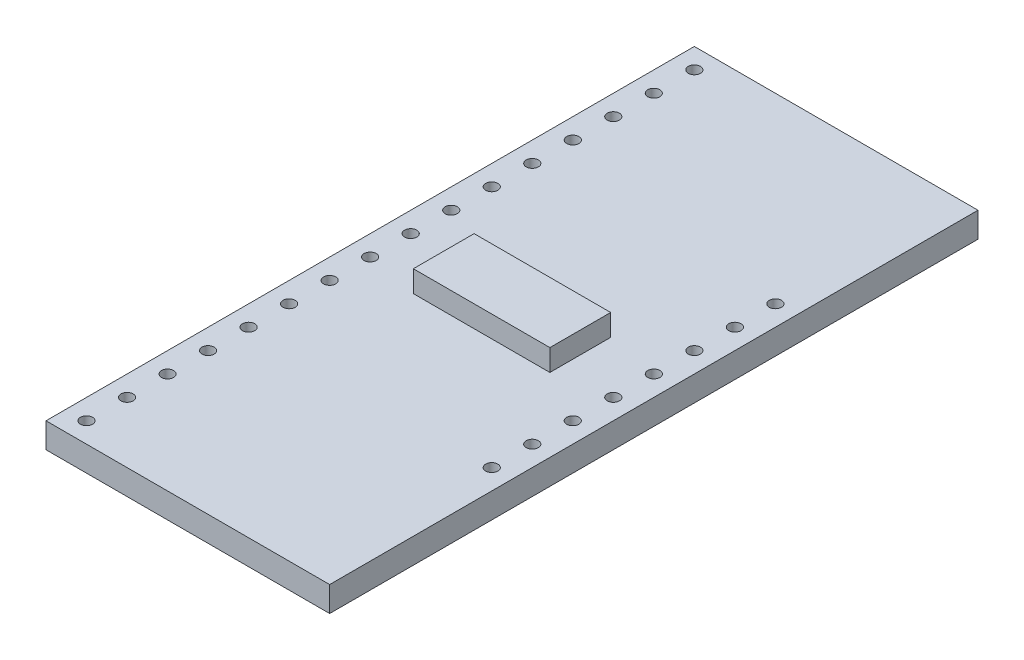
ISO-10303-21;
HEADER;
FILE_DESCRIPTION(('STEP AP214'),'2;1');
FILE_NAME('part.step','',(''),(''),'','','');
FILE_SCHEMA(('AUTOMOTIVE_DESIGN { 1 0 10303 214 1 1 1 1 }'));
ENDSEC;
DATA;
#1=APPLICATION_CONTEXT('core data for automotive mechanical design processes');
#2=APPLICATION_PROTOCOL_DEFINITION('international standard','automotive_design',2000,#1);
#3=PRODUCT_CONTEXT('',#1,'mechanical');
#4=PRODUCT('Part','Part','',(#3));
#5=PRODUCT_RELATED_PRODUCT_CATEGORY('part','',(#4));
#6=PRODUCT_DEFINITION_FORMATION('','',#4);
#7=PRODUCT_DEFINITION_CONTEXT('part definition',#1,'design');
#8=PRODUCT_DEFINITION('design','',#6,#7);
#9=PRODUCT_DEFINITION_SHAPE('','',#8);
#10=(LENGTH_UNIT() NAMED_UNIT(*) SI_UNIT(.MILLI.,.METRE.));
#11=(NAMED_UNIT(*) PLANE_ANGLE_UNIT() SI_UNIT($,.RADIAN.));
#12=(NAMED_UNIT(*) SI_UNIT($,.STERADIAN.) SOLID_ANGLE_UNIT());
#13=UNCERTAINTY_MEASURE_WITH_UNIT(LENGTH_MEASURE(1.E-05),#10,'distance_accuracy_value','');
#14=(GEOMETRIC_REPRESENTATION_CONTEXT(3) GLOBAL_UNCERTAINTY_ASSIGNED_CONTEXT((#13)) GLOBAL_UNIT_ASSIGNED_CONTEXT((#10,
#11,#12)) REPRESENTATION_CONTEXT('',''));
#15=CARTESIAN_POINT('',(0.,0.,0.));
#16=DIRECTION('',(0.,0.,1.));
#17=DIRECTION('',(1.,0.,0.));
#18=AXIS2_PLACEMENT_3D('',#15,#16,#17);
#19=CARTESIAN_POINT('',(0.,1.5748,0.));
#20=DIRECTION('',(0.,-1.,0.));
#21=DIRECTION('',(0.,0.,-1.));
#22=AXIS2_PLACEMENT_3D('',#19,#20,#21);
#23=PLANE('',#22);
#24=CARTESIAN_POINT('',(16.51,1.5748,-29.21));
#25=DIRECTION('',(0.,1.,0.));
#26=DIRECTION('',(0.,0.,1.));
#27=AXIS2_PLACEMENT_3D('',#24,#25,#26);
#28=CIRCLE('',#27,0.380999999999998);
#29=CARTESIAN_POINT('',(16.51,1.5748,-28.829));
#30=VERTEX_POINT('',#29);
#31=EDGE_CURVE('E11',#30,#30,#28,.T.);
#32=ORIENTED_EDGE('',*,*,#31,.F.);
#33=EDGE_LOOP('',(#32));
#34=FACE_BOUND('',#33,.T.);
#35=CARTESIAN_POINT('',(16.51,1.5748,-26.67));
#36=DIRECTION('',(0.,1.,0.));
#37=DIRECTION('',(0.,0.,1.));
#38=AXIS2_PLACEMENT_3D('',#35,#36,#37);
#39=CIRCLE('',#38,0.380999999999998);
#40=CARTESIAN_POINT('',(16.51,1.5748,-26.289));
#41=VERTEX_POINT('',#40);
#42=EDGE_CURVE('E288',#41,#41,#39,.T.);
#43=ORIENTED_EDGE('',*,*,#42,.F.);
#44=EDGE_LOOP('',(#43));
#45=FACE_BOUND('',#44,.T.);
#46=CARTESIAN_POINT('',(16.51,1.5748,-24.13));
#47=DIRECTION('',(0.,1.,0.));
#48=DIRECTION('',(0.,0.,1.));
#49=AXIS2_PLACEMENT_3D('',#46,#47,#48);
#50=CIRCLE('',#49,0.380999999999998);
#51=CARTESIAN_POINT('',(16.51,1.5748,-23.749));
#52=VERTEX_POINT('',#51);
#53=EDGE_CURVE('E282',#52,#52,#50,.T.);
#54=ORIENTED_EDGE('',*,*,#53,.F.);
#55=EDGE_LOOP('',(#54));
#56=FACE_BOUND('',#55,.T.);
#57=CARTESIAN_POINT('',(16.51,1.5748,-21.59));
#58=DIRECTION('',(0.,1.,0.));
#59=DIRECTION('',(0.,0.,1.));
#60=AXIS2_PLACEMENT_3D('',#57,#58,#59);
#61=CIRCLE('',#60,0.380999999999998);
#62=CARTESIAN_POINT('',(16.51,1.5748,-21.209));
#63=VERTEX_POINT('',#62);
#64=EDGE_CURVE('E276',#63,#63,#61,.T.);
#65=ORIENTED_EDGE('',*,*,#64,.F.);
#66=EDGE_LOOP('',(#65));
#67=FACE_BOUND('',#66,.T.);
#68=CARTESIAN_POINT('',(16.51,1.5748,-19.05));
#69=DIRECTION('',(0.,1.,0.));
#70=DIRECTION('',(0.,0.,1.));
#71=AXIS2_PLACEMENT_3D('',#68,#69,#70);
#72=CIRCLE('',#71,0.380999999999998);
#73=CARTESIAN_POINT('',(16.51,1.5748,-18.669));
#74=VERTEX_POINT('',#73);
#75=EDGE_CURVE('E270',#74,#74,#72,.T.);
#76=ORIENTED_EDGE('',*,*,#75,.F.);
#77=EDGE_LOOP('',(#76));
#78=FACE_BOUND('',#77,.T.);
#79=CARTESIAN_POINT('',(16.51,1.5748,-16.51));
#80=DIRECTION('',(0.,1.,0.));
#81=DIRECTION('',(0.,0.,1.));
#82=AXIS2_PLACEMENT_3D('',#79,#80,#81);
#83=CIRCLE('',#82,0.380999999999998);
#84=CARTESIAN_POINT('',(16.51,1.5748,-16.129));
#85=VERTEX_POINT('',#84);
#86=EDGE_CURVE('E264',#85,#85,#83,.T.);
#87=ORIENTED_EDGE('',*,*,#86,.F.);
#88=EDGE_LOOP('',(#87));
#89=FACE_BOUND('',#88,.T.);
#90=CARTESIAN_POINT('',(1.27,1.5748,-39.37));
#91=DIRECTION('',(0.,1.,0.));
#92=DIRECTION('',(0.,0.,1.));
#93=AXIS2_PLACEMENT_3D('',#90,#91,#92);
#94=CIRCLE('',#93,0.381);
#95=CARTESIAN_POINT('',(1.27,1.5748,-38.989));
#96=VERTEX_POINT('',#95);
#97=EDGE_CURVE('E258',#96,#96,#94,.T.);
#98=ORIENTED_EDGE('',*,*,#97,.F.);
#99=EDGE_LOOP('',(#98));
#100=FACE_BOUND('',#99,.T.);
#101=CARTESIAN_POINT('',(1.27,1.5748,-36.83));
#102=DIRECTION('',(0.,1.,0.));
#103=DIRECTION('',(0.,0.,1.));
#104=AXIS2_PLACEMENT_3D('',#101,#102,#103);
#105=CIRCLE('',#104,0.381);
#106=CARTESIAN_POINT('',(1.27,1.5748,-36.449));
#107=VERTEX_POINT('',#106);
#108=EDGE_CURVE('E252',#107,#107,#105,.T.);
#109=ORIENTED_EDGE('',*,*,#108,.F.);
#110=EDGE_LOOP('',(#109));
#111=FACE_BOUND('',#110,.T.);
#112=CARTESIAN_POINT('',(1.27,1.5748,-34.29));
#113=DIRECTION('',(0.,1.,0.));
#114=DIRECTION('',(0.,0.,1.));
#115=AXIS2_PLACEMENT_3D('',#112,#113,#114);
#116=CIRCLE('',#115,0.381);
#117=CARTESIAN_POINT('',(1.27,1.5748,-33.909));
#118=VERTEX_POINT('',#117);
#119=EDGE_CURVE('E246',#118,#118,#116,.T.);
#120=ORIENTED_EDGE('',*,*,#119,.F.);
#121=EDGE_LOOP('',(#120));
#122=FACE_BOUND('',#121,.T.);
#123=CARTESIAN_POINT('',(1.27,1.5748,-31.75));
#124=DIRECTION('',(0.,1.,0.));
#125=DIRECTION('',(0.,0.,1.));
#126=AXIS2_PLACEMENT_3D('',#123,#124,#125);
#127=CIRCLE('',#126,0.381);
#128=CARTESIAN_POINT('',(1.27,1.5748,-31.369));
#129=VERTEX_POINT('',#128);
#130=EDGE_CURVE('E240',#129,#129,#127,.T.);
#131=ORIENTED_EDGE('',*,*,#130,.F.);
#132=EDGE_LOOP('',(#131));
#133=FACE_BOUND('',#132,.T.);
#134=CARTESIAN_POINT('',(1.27,1.5748,-29.21));
#135=DIRECTION('',(0.,1.,0.));
#136=DIRECTION('',(0.,0.,1.));
#137=AXIS2_PLACEMENT_3D('',#134,#135,#136);
#138=CIRCLE('',#137,0.381);
#139=CARTESIAN_POINT('',(1.27,1.5748,-28.829));
#140=VERTEX_POINT('',#139);
#141=EDGE_CURVE('E234',#140,#140,#138,.T.);
#142=ORIENTED_EDGE('',*,*,#141,.F.);
#143=EDGE_LOOP('',(#142));
#144=FACE_BOUND('',#143,.T.);
#145=CARTESIAN_POINT('',(1.27,1.5748,-26.67));
#146=DIRECTION('',(0.,1.,0.));
#147=DIRECTION('',(0.,0.,1.));
#148=AXIS2_PLACEMENT_3D('',#145,#146,#147);
#149=CIRCLE('',#148,0.381);
#150=CARTESIAN_POINT('',(1.27,1.5748,-26.289));
#151=VERTEX_POINT('',#150);
#152=EDGE_CURVE('E228',#151,#151,#149,.T.);
#153=ORIENTED_EDGE('',*,*,#152,.F.);
#154=EDGE_LOOP('',(#153));
#155=FACE_BOUND('',#154,.T.);
#156=CARTESIAN_POINT('',(1.27,1.5748,-24.13));
#157=DIRECTION('',(0.,1.,0.));
#158=DIRECTION('',(0.,0.,1.));
#159=AXIS2_PLACEMENT_3D('',#156,#157,#158);
#160=CIRCLE('',#159,0.381);
#161=CARTESIAN_POINT('',(1.27,1.5748,-23.749));
#162=VERTEX_POINT('',#161);
#163=EDGE_CURVE('E222',#162,#162,#160,.T.);
#164=ORIENTED_EDGE('',*,*,#163,.F.);
#165=EDGE_LOOP('',(#164));
#166=FACE_BOUND('',#165,.T.);
#167=CARTESIAN_POINT('',(1.27,1.5748,-21.59));
#168=DIRECTION('',(0.,1.,0.));
#169=DIRECTION('',(0.,0.,1.));
#170=AXIS2_PLACEMENT_3D('',#167,#168,#169);
#171=CIRCLE('',#170,0.381);
#172=CARTESIAN_POINT('',(1.27,1.5748,-21.209));
#173=VERTEX_POINT('',#172);
#174=EDGE_CURVE('E216',#173,#173,#171,.T.);
#175=ORIENTED_EDGE('',*,*,#174,.F.);
#176=EDGE_LOOP('',(#175));
#177=FACE_BOUND('',#176,.T.);
#178=CARTESIAN_POINT('',(1.27,1.5748,-19.05));
#179=DIRECTION('',(0.,1.,0.));
#180=DIRECTION('',(0.,0.,1.));
#181=AXIS2_PLACEMENT_3D('',#178,#179,#180);
#182=CIRCLE('',#181,0.381);
#183=CARTESIAN_POINT('',(1.27,1.5748,-18.669));
#184=VERTEX_POINT('',#183);
#185=EDGE_CURVE('E210',#184,#184,#182,.T.);
#186=ORIENTED_EDGE('',*,*,#185,.F.);
#187=EDGE_LOOP('',(#186));
#188=FACE_BOUND('',#187,.T.);
#189=CARTESIAN_POINT('',(1.27,1.5748,-16.51));
#190=DIRECTION('',(0.,1.,0.));
#191=DIRECTION('',(0.,0.,1.));
#192=AXIS2_PLACEMENT_3D('',#189,#190,#191);
#193=CIRCLE('',#192,0.381);
#194=CARTESIAN_POINT('',(1.27,1.5748,-16.129));
#195=VERTEX_POINT('',#194);
#196=EDGE_CURVE('E204',#195,#195,#193,.T.);
#197=ORIENTED_EDGE('',*,*,#196,.F.);
#198=EDGE_LOOP('',(#197));
#199=FACE_BOUND('',#198,.T.);
#200=CARTESIAN_POINT('',(1.27,1.5748,-13.97));
#201=DIRECTION('',(0.,1.,0.));
#202=DIRECTION('',(0.,0.,1.));
#203=AXIS2_PLACEMENT_3D('',#200,#201,#202);
#204=CIRCLE('',#203,0.381);
#205=CARTESIAN_POINT('',(1.27,1.5748,-13.589));
#206=VERTEX_POINT('',#205);
#207=EDGE_CURVE('E198',#206,#206,#204,.T.);
#208=ORIENTED_EDGE('',*,*,#207,.F.);
#209=EDGE_LOOP('',(#208));
#210=FACE_BOUND('',#209,.T.);
#211=CARTESIAN_POINT('',(1.27,1.5748,-11.43));
#212=DIRECTION('',(0.,1.,0.));
#213=DIRECTION('',(0.,0.,1.));
#214=AXIS2_PLACEMENT_3D('',#211,#212,#213);
#215=CIRCLE('',#214,0.381);
#216=CARTESIAN_POINT('',(1.27,1.5748,-11.049));
#217=VERTEX_POINT('',#216);
#218=EDGE_CURVE('E192',#217,#217,#215,.T.);
#219=ORIENTED_EDGE('',*,*,#218,.F.);
#220=EDGE_LOOP('',(#219));
#221=FACE_BOUND('',#220,.T.);
#222=CARTESIAN_POINT('',(1.27,1.5748,-8.89));
#223=DIRECTION('',(0.,1.,0.));
#224=DIRECTION('',(0.,0.,1.));
#225=AXIS2_PLACEMENT_3D('',#222,#223,#224);
#226=CIRCLE('',#225,0.381);
#227=CARTESIAN_POINT('',(1.27,1.5748,-8.509));
#228=VERTEX_POINT('',#227);
#229=EDGE_CURVE('E186',#228,#228,#226,.T.);
#230=ORIENTED_EDGE('',*,*,#229,.F.);
#231=EDGE_LOOP('',(#230));
#232=FACE_BOUND('',#231,.T.);
#233=CARTESIAN_POINT('',(1.27,1.5748,-6.35));
#234=DIRECTION('',(0.,1.,0.));
#235=DIRECTION('',(0.,0.,1.));
#236=AXIS2_PLACEMENT_3D('',#233,#234,#235);
#237=CIRCLE('',#236,0.381);
#238=CARTESIAN_POINT('',(1.27,1.5748,-5.969));
#239=VERTEX_POINT('',#238);
#240=EDGE_CURVE('E180',#239,#239,#237,.T.);
#241=ORIENTED_EDGE('',*,*,#240,.F.);
#242=EDGE_LOOP('',(#241));
#243=FACE_BOUND('',#242,.T.);
#244=DIRECTION('',(0.,0.,1.));
#245=VECTOR('',#244,1.);
#246=CARTESIAN_POINT('',(0.,1.5748,0.));
#247=LINE('',#246,#245);
#248=CARTESIAN_POINT('',(0.,1.5748,-40.64));
#249=VERTEX_POINT('',#248);
#250=CARTESIAN_POINT('',(0.,1.5748,0.));
#251=VERTEX_POINT('',#250);
#252=EDGE_CURVE('E148',#249,#251,#247,.T.);
#253=ORIENTED_EDGE('',*,*,#252,.T.);
#254=DIRECTION('',(1.,0.,0.));
#255=VECTOR('',#254,1.);
#256=CARTESIAN_POINT('',(0.,1.5748,0.));
#257=LINE('',#256,#255);
#258=CARTESIAN_POINT('',(17.78,1.5748,0.));
#259=VERTEX_POINT('',#258);
#260=EDGE_CURVE('E151',#251,#259,#257,.T.);
#261=ORIENTED_EDGE('',*,*,#260,.T.);
#262=DIRECTION('',(0.,0.,-1.));
#263=VECTOR('',#262,1.);
#264=CARTESIAN_POINT('',(17.78,1.5748,0.));
#265=LINE('',#264,#263);
#266=CARTESIAN_POINT('',(17.78,1.5748,-40.64));
#267=VERTEX_POINT('',#266);
#268=EDGE_CURVE('E154',#259,#267,#265,.T.);
#269=ORIENTED_EDGE('',*,*,#268,.T.);
#270=DIRECTION('',(-1.,0.,0.));
#271=VECTOR('',#270,1.);
#272=CARTESIAN_POINT('',(0.,1.5748,-40.64));
#273=LINE('',#272,#271);
#274=EDGE_CURVE('E156',#267,#249,#273,.T.);
#275=ORIENTED_EDGE('',*,*,#274,.T.);
#276=EDGE_LOOP('',(#253,#261,#269,#275));
#277=FACE_BOUND('',#276,.T.);
#278=CARTESIAN_POINT('',(1.27,1.5748,-1.27));
#279=DIRECTION('',(0.,1.,0.));
#280=DIRECTION('',(0.,0.,1.));
#281=AXIS2_PLACEMENT_3D('',#278,#279,#280);
#282=CIRCLE('',#281,0.381);
#283=CARTESIAN_POINT('',(1.27,1.5748,-0.889));
#284=VERTEX_POINT('',#283);
#285=EDGE_CURVE('E141',#284,#284,#282,.T.);
#286=ORIENTED_EDGE('',*,*,#285,.F.);
#287=EDGE_LOOP('',(#286));
#288=FACE_BOUND('',#287,.T.);
#289=CARTESIAN_POINT('',(1.27,1.5748,-3.81));
#290=DIRECTION('',(0.,1.,0.));
#291=DIRECTION('',(0.,0.,1.));
#292=AXIS2_PLACEMENT_3D('',#289,#290,#291);
#293=CIRCLE('',#292,0.381);
#294=CARTESIAN_POINT('',(1.27,1.5748,-3.429));
#295=VERTEX_POINT('',#294);
#296=EDGE_CURVE('E138',#295,#295,#293,.T.);
#297=ORIENTED_EDGE('',*,*,#296,.F.);
#298=EDGE_LOOP('',(#297));
#299=FACE_BOUND('',#298,.T.);
#300=CARTESIAN_POINT('',(16.51,1.5748,-11.43));
#301=DIRECTION('',(0.,1.,0.));
#302=DIRECTION('',(0.,0.,1.));
#303=AXIS2_PLACEMENT_3D('',#300,#301,#302);
#304=CIRCLE('',#303,0.380999999999998);
#305=CARTESIAN_POINT('',(16.51,1.5748,-11.049));
#306=VERTEX_POINT('',#305);
#307=EDGE_CURVE('E129',#306,#306,#304,.T.);
#308=ORIENTED_EDGE('',*,*,#307,.F.);
#309=EDGE_LOOP('',(#308));
#310=FACE_BOUND('',#309,.T.);
#311=CARTESIAN_POINT('',(16.51,1.5748,-13.97));
#312=DIRECTION('',(0.,1.,0.));
#313=DIRECTION('',(0.,0.,1.));
#314=AXIS2_PLACEMENT_3D('',#311,#312,#313);
#315=CIRCLE('',#314,0.380999999999998);
#316=CARTESIAN_POINT('',(16.51,1.5748,-13.589));
#317=VERTEX_POINT('',#316);
#318=EDGE_CURVE('E121',#317,#317,#315,.T.);
#319=ORIENTED_EDGE('',*,*,#318,.F.);
#320=EDGE_LOOP('',(#319));
#321=FACE_BOUND('',#320,.T.);
#322=DIRECTION('',(0.,0.,-1.));
#323=VECTOR('',#322,1.);
#324=CARTESIAN_POINT('',(13.1699,1.5748,-18.415));
#325=LINE('',#324,#323);
#326=CARTESIAN_POINT('',(13.1699,1.5748,-18.415));
#327=VERTEX_POINT('',#326);
#328=CARTESIAN_POINT('',(13.1699,1.5748,-22.225));
#329=VERTEX_POINT('',#328);
#330=EDGE_CURVE('E117',#327,#329,#325,.T.);
#331=ORIENTED_EDGE('',*,*,#330,.F.);
#332=DIRECTION('',(1.,0.,0.));
#333=VECTOR('',#332,1.);
#334=CARTESIAN_POINT('',(4.6101,1.5748,-18.415));
#335=LINE('',#334,#333);
#336=CARTESIAN_POINT('',(4.6101,1.5748,-18.415));
#337=VERTEX_POINT('',#336);
#338=EDGE_CURVE('E114',#337,#327,#335,.T.);
#339=ORIENTED_EDGE('',*,*,#338,.F.);
#340=DIRECTION('',(0.,0.,1.));
#341=VECTOR('',#340,1.);
#342=CARTESIAN_POINT('',(4.6101,1.5748,-18.415));
#343=LINE('',#342,#341);
#344=CARTESIAN_POINT('',(4.6101,1.5748,-22.225));
#345=VERTEX_POINT('',#344);
#346=EDGE_CURVE('E52',#345,#337,#343,.T.);
#347=ORIENTED_EDGE('',*,*,#346,.F.);
#348=DIRECTION('',(-1.,0.,0.));
#349=VECTOR('',#348,1.);
#350=CARTESIAN_POINT('',(4.6101,1.5748,-22.225));
#351=LINE('',#350,#349);
#352=EDGE_CURVE('E47',#329,#345,#351,.T.);
#353=ORIENTED_EDGE('',*,*,#352,.F.);
#354=EDGE_LOOP('',(#331,#339,#347,#353));
#355=FACE_BOUND('',#354,.T.);
#356=ADVANCED_FACE('F32',(#34,#45,#56,#67,#78,#89,#100,#111,#122,#133,#144,#155,#166,#177,#188,
#199,#210,#221,#232,#243,#277,#288,#299,#310,#321,#355),#23,.F.);
#357=CARTESIAN_POINT('',(0.,1.5748,0.));
#358=DIRECTION('',(1.,0.,0.));
#359=DIRECTION('',(0.,0.,-1.));
#360=AXIS2_PLACEMENT_3D('',#357,#358,#359);
#361=PLANE('',#360);
#362=DIRECTION('',(0.,0.,1.));
#363=VECTOR('',#362,1.);
#364=CARTESIAN_POINT('',(0.,0.,0.));
#365=LINE('',#364,#363);
#366=CARTESIAN_POINT('',(0.,0.,-40.64));
#367=VERTEX_POINT('',#366);
#368=CARTESIAN_POINT('',(0.,0.,0.));
#369=VERTEX_POINT('',#368);
#370=EDGE_CURVE('E145',#367,#369,#365,.T.);
#371=ORIENTED_EDGE('',*,*,#370,.T.);
#372=DIRECTION('',(0.,-1.,0.));
#373=VECTOR('',#372,1.);
#374=CARTESIAN_POINT('',(0.,1.5748,0.));
#375=LINE('',#374,#373);
#376=EDGE_CURVE('E174',#251,#369,#375,.T.);
#377=ORIENTED_EDGE('',*,*,#376,.F.);
#378=ORIENTED_EDGE('',*,*,#252,.F.);
#379=DIRECTION('',(0.,-1.,0.));
#380=VECTOR('',#379,1.);
#381=CARTESIAN_POINT('',(0.,1.5748,-40.64));
#382=LINE('',#381,#380);
#383=EDGE_CURVE('E158',#249,#367,#382,.T.);
#384=ORIENTED_EDGE('',*,*,#383,.T.);
#385=EDGE_LOOP('',(#371,#377,#378,#384));
#386=FACE_BOUND('',#385,.T.);
#387=ADVANCED_FACE('F302',(#386),#361,.F.);
#388=CARTESIAN_POINT('',(0.,1.5748,0.));
#389=DIRECTION('',(0.,0.,-1.));
#390=DIRECTION('',(-1.,0.,0.));
#391=AXIS2_PLACEMENT_3D('',#388,#389,#390);
#392=PLANE('',#391);
#393=DIRECTION('',(1.,0.,0.));
#394=VECTOR('',#393,1.);
#395=CARTESIAN_POINT('',(0.,0.,0.));
#396=LINE('',#395,#394);
#397=CARTESIAN_POINT('',(17.78,0.,0.));
#398=VERTEX_POINT('',#397);
#399=EDGE_CURVE('E161',#369,#398,#396,.T.);
#400=ORIENTED_EDGE('',*,*,#399,.T.);
#401=DIRECTION('',(0.,-1.,0.));
#402=VECTOR('',#401,1.);
#403=CARTESIAN_POINT('',(17.78,1.5748,0.));
#404=LINE('',#403,#402);
#405=EDGE_CURVE('E171',#259,#398,#404,.T.);
#406=ORIENTED_EDGE('',*,*,#405,.F.);
#407=ORIENTED_EDGE('',*,*,#260,.F.);
#408=ORIENTED_EDGE('',*,*,#376,.T.);
#409=EDGE_LOOP('',(#400,#406,#407,#408));
#410=FACE_BOUND('',#409,.T.);
#411=ADVANCED_FACE('F408',(#410),#392,.F.);
#412=CARTESIAN_POINT('',(17.78,1.5748,0.));
#413=DIRECTION('',(-1.,0.,0.));
#414=DIRECTION('',(0.,0.,1.));
#415=AXIS2_PLACEMENT_3D('',#412,#413,#414);
#416=PLANE('',#415);
#417=DIRECTION('',(0.,0.,-1.));
#418=VECTOR('',#417,1.);
#419=CARTESIAN_POINT('',(17.78,0.,0.));
#420=LINE('',#419,#418);
#421=CARTESIAN_POINT('',(17.78,0.,-40.64));
#422=VERTEX_POINT('',#421);
#423=EDGE_CURVE('E163',#398,#422,#420,.T.);
#424=ORIENTED_EDGE('',*,*,#423,.T.);
#425=DIRECTION('',(0.,-1.,0.));
#426=VECTOR('',#425,1.);
#427=CARTESIAN_POINT('',(17.78,1.5748,-40.64));
#428=LINE('',#427,#426);
#429=EDGE_CURVE('E168',#267,#422,#428,.T.);
#430=ORIENTED_EDGE('',*,*,#429,.F.);
#431=ORIENTED_EDGE('',*,*,#268,.F.);
#432=ORIENTED_EDGE('',*,*,#405,.T.);
#433=EDGE_LOOP('',(#424,#430,#431,#432));
#434=FACE_BOUND('',#433,.T.);
#435=ADVANCED_FACE('F404',(#434),#416,.F.);
#436=CARTESIAN_POINT('',(0.,1.5748,-40.64));
#437=DIRECTION('',(0.,0.,1.));
#438=DIRECTION('',(1.,0.,0.));
#439=AXIS2_PLACEMENT_3D('',#436,#437,#438);
#440=PLANE('',#439);
#441=DIRECTION('',(-1.,0.,0.));
#442=VECTOR('',#441,1.);
#443=CARTESIAN_POINT('',(0.,0.,-40.64));
#444=LINE('',#443,#442);
#445=EDGE_CURVE('E152',#422,#367,#444,.T.);
#446=ORIENTED_EDGE('',*,*,#445,.T.);
#447=ORIENTED_EDGE('',*,*,#383,.F.);
#448=ORIENTED_EDGE('',*,*,#274,.F.);
#449=ORIENTED_EDGE('',*,*,#429,.T.);
#450=EDGE_LOOP('',(#446,#447,#448,#449));
#451=FACE_BOUND('',#450,.T.);
#452=ADVANCED_FACE('F400',(#451),#440,.F.);
#453=CARTESIAN_POINT('',(0.,0.,0.));
#454=DIRECTION('',(0.,-1.,0.));
#455=DIRECTION('',(0.,0.,-1.));
#456=AXIS2_PLACEMENT_3D('',#453,#454,#455);
#457=PLANE('',#456);
#458=CARTESIAN_POINT('',(16.51,0.,-13.97));
#459=DIRECTION('',(0.,1.,0.));
#460=DIRECTION('',(0.,0.,1.));
#461=AXIS2_PLACEMENT_3D('',#458,#459,#460);
#462=CIRCLE('',#461,0.380999999999998);
#463=CARTESIAN_POINT('',(16.51,0.,-13.589));
#464=VERTEX_POINT('',#463);
#465=EDGE_CURVE('E118',#464,#464,#462,.T.);
#466=ORIENTED_EDGE('',*,*,#465,.T.);
#467=EDGE_LOOP('',(#466));
#468=FACE_BOUND('',#467,.T.);
#469=CARTESIAN_POINT('',(16.51,0.,-11.43));
#470=DIRECTION('',(0.,1.,0.));
#471=DIRECTION('',(0.,0.,1.));
#472=AXIS2_PLACEMENT_3D('',#469,#470,#471);
#473=CIRCLE('',#472,0.380999999999998);
#474=CARTESIAN_POINT('',(16.51,0.,-11.049));
#475=VERTEX_POINT('',#474);
#476=EDGE_CURVE('E130',#475,#475,#473,.T.);
#477=ORIENTED_EDGE('',*,*,#476,.T.);
#478=EDGE_LOOP('',(#477));
#479=FACE_BOUND('',#478,.T.);
#480=CARTESIAN_POINT('',(1.27,0.,-3.81));
#481=DIRECTION('',(0.,1.,0.));
#482=DIRECTION('',(0.,0.,1.));
#483=AXIS2_PLACEMENT_3D('',#480,#481,#482);
#484=CIRCLE('',#483,0.381);
#485=CARTESIAN_POINT('',(1.27,0.,-3.429));
#486=VERTEX_POINT('',#485);
#487=EDGE_CURVE('E133',#486,#486,#484,.T.);
#488=ORIENTED_EDGE('',*,*,#487,.T.);
#489=EDGE_LOOP('',(#488));
#490=FACE_BOUND('',#489,.T.);
#491=CARTESIAN_POINT('',(1.27,0.,-1.27));
#492=DIRECTION('',(0.,1.,0.));
#493=DIRECTION('',(0.,0.,1.));
#494=AXIS2_PLACEMENT_3D('',#491,#492,#493);
#495=CIRCLE('',#494,0.381);
#496=CARTESIAN_POINT('',(1.27,0.,-0.889));
#497=VERTEX_POINT('',#496);
#498=EDGE_CURVE('E142',#497,#497,#495,.T.);
#499=ORIENTED_EDGE('',*,*,#498,.T.);
#500=EDGE_LOOP('',(#499));
#501=FACE_BOUND('',#500,.T.);
#502=ORIENTED_EDGE('',*,*,#370,.F.);
#503=ORIENTED_EDGE('',*,*,#445,.F.);
#504=ORIENTED_EDGE('',*,*,#423,.F.);
#505=ORIENTED_EDGE('',*,*,#399,.F.);
#506=EDGE_LOOP('',(#502,#503,#504,#505));
#507=FACE_BOUND('',#506,.T.);
#508=CARTESIAN_POINT('',(1.27,0.,-6.35));
#509=DIRECTION('',(0.,1.,0.));
#510=DIRECTION('',(0.,0.,1.));
#511=AXIS2_PLACEMENT_3D('',#508,#509,#510);
#512=CIRCLE('',#511,0.381);
#513=CARTESIAN_POINT('',(1.27,0.,-5.969));
#514=VERTEX_POINT('',#513);
#515=EDGE_CURVE('E177',#514,#514,#512,.T.);
#516=ORIENTED_EDGE('',*,*,#515,.T.);
#517=EDGE_LOOP('',(#516));
#518=FACE_BOUND('',#517,.T.);
#519=CARTESIAN_POINT('',(1.27,0.,-8.89));
#520=DIRECTION('',(0.,1.,0.));
#521=DIRECTION('',(0.,0.,1.));
#522=AXIS2_PLACEMENT_3D('',#519,#520,#521);
#523=CIRCLE('',#522,0.381);
#524=CARTESIAN_POINT('',(1.27,0.,-8.509));
#525=VERTEX_POINT('',#524);
#526=EDGE_CURVE('E183',#525,#525,#523,.T.);
#527=ORIENTED_EDGE('',*,*,#526,.T.);
#528=EDGE_LOOP('',(#527));
#529=FACE_BOUND('',#528,.T.);
#530=CARTESIAN_POINT('',(1.27,0.,-11.43));
#531=DIRECTION('',(0.,1.,0.));
#532=DIRECTION('',(0.,0.,1.));
#533=AXIS2_PLACEMENT_3D('',#530,#531,#532);
#534=CIRCLE('',#533,0.381);
#535=CARTESIAN_POINT('',(1.27,0.,-11.049));
#536=VERTEX_POINT('',#535);
#537=EDGE_CURVE('E189',#536,#536,#534,.T.);
#538=ORIENTED_EDGE('',*,*,#537,.T.);
#539=EDGE_LOOP('',(#538));
#540=FACE_BOUND('',#539,.T.);
#541=CARTESIAN_POINT('',(1.27,0.,-13.97));
#542=DIRECTION('',(0.,1.,0.));
#543=DIRECTION('',(0.,0.,1.));
#544=AXIS2_PLACEMENT_3D('',#541,#542,#543);
#545=CIRCLE('',#544,0.381);
#546=CARTESIAN_POINT('',(1.27,0.,-13.589));
#547=VERTEX_POINT('',#546);
#548=EDGE_CURVE('E195',#547,#547,#545,.T.);
#549=ORIENTED_EDGE('',*,*,#548,.T.);
#550=EDGE_LOOP('',(#549));
#551=FACE_BOUND('',#550,.T.);
#552=CARTESIAN_POINT('',(1.27,0.,-16.51));
#553=DIRECTION('',(0.,1.,0.));
#554=DIRECTION('',(0.,0.,1.));
#555=AXIS2_PLACEMENT_3D('',#552,#553,#554);
#556=CIRCLE('',#555,0.381);
#557=CARTESIAN_POINT('',(1.27,0.,-16.129));
#558=VERTEX_POINT('',#557);
#559=EDGE_CURVE('E201',#558,#558,#556,.T.);
#560=ORIENTED_EDGE('',*,*,#559,.T.);
#561=EDGE_LOOP('',(#560));
#562=FACE_BOUND('',#561,.T.);
#563=CARTESIAN_POINT('',(1.27,0.,-19.05));
#564=DIRECTION('',(0.,1.,0.));
#565=DIRECTION('',(0.,0.,1.));
#566=AXIS2_PLACEMENT_3D('',#563,#564,#565);
#567=CIRCLE('',#566,0.381);
#568=CARTESIAN_POINT('',(1.27,0.,-18.669));
#569=VERTEX_POINT('',#568);
#570=EDGE_CURVE('E207',#569,#569,#567,.T.);
#571=ORIENTED_EDGE('',*,*,#570,.T.);
#572=EDGE_LOOP('',(#571));
#573=FACE_BOUND('',#572,.T.);
#574=CARTESIAN_POINT('',(1.27,0.,-21.59));
#575=DIRECTION('',(0.,1.,0.));
#576=DIRECTION('',(0.,0.,1.));
#577=AXIS2_PLACEMENT_3D('',#574,#575,#576);
#578=CIRCLE('',#577,0.381);
#579=CARTESIAN_POINT('',(1.27,0.,-21.209));
#580=VERTEX_POINT('',#579);
#581=EDGE_CURVE('E213',#580,#580,#578,.T.);
#582=ORIENTED_EDGE('',*,*,#581,.T.);
#583=EDGE_LOOP('',(#582));
#584=FACE_BOUND('',#583,.T.);
#585=CARTESIAN_POINT('',(1.27,0.,-24.13));
#586=DIRECTION('',(0.,1.,0.));
#587=DIRECTION('',(0.,0.,1.));
#588=AXIS2_PLACEMENT_3D('',#585,#586,#587);
#589=CIRCLE('',#588,0.381);
#590=CARTESIAN_POINT('',(1.27,0.,-23.749));
#591=VERTEX_POINT('',#590);
#592=EDGE_CURVE('E219',#591,#591,#589,.T.);
#593=ORIENTED_EDGE('',*,*,#592,.T.);
#594=EDGE_LOOP('',(#593));
#595=FACE_BOUND('',#594,.T.);
#596=CARTESIAN_POINT('',(1.27,0.,-26.67));
#597=DIRECTION('',(0.,1.,0.));
#598=DIRECTION('',(0.,0.,1.));
#599=AXIS2_PLACEMENT_3D('',#596,#597,#598);
#600=CIRCLE('',#599,0.381);
#601=CARTESIAN_POINT('',(1.27,0.,-26.289));
#602=VERTEX_POINT('',#601);
#603=EDGE_CURVE('E225',#602,#602,#600,.T.);
#604=ORIENTED_EDGE('',*,*,#603,.T.);
#605=EDGE_LOOP('',(#604));
#606=FACE_BOUND('',#605,.T.);
#607=CARTESIAN_POINT('',(1.27,0.,-29.21));
#608=DIRECTION('',(0.,1.,0.));
#609=DIRECTION('',(0.,0.,1.));
#610=AXIS2_PLACEMENT_3D('',#607,#608,#609);
#611=CIRCLE('',#610,0.381);
#612=CARTESIAN_POINT('',(1.27,0.,-28.829));
#613=VERTEX_POINT('',#612);
#614=EDGE_CURVE('E231',#613,#613,#611,.T.);
#615=ORIENTED_EDGE('',*,*,#614,.T.);
#616=EDGE_LOOP('',(#615));
#617=FACE_BOUND('',#616,.T.);
#618=CARTESIAN_POINT('',(1.27,0.,-31.75));
#619=DIRECTION('',(0.,1.,0.));
#620=DIRECTION('',(0.,0.,1.));
#621=AXIS2_PLACEMENT_3D('',#618,#619,#620);
#622=CIRCLE('',#621,0.381);
#623=CARTESIAN_POINT('',(1.27,0.,-31.369));
#624=VERTEX_POINT('',#623);
#625=EDGE_CURVE('E237',#624,#624,#622,.T.);
#626=ORIENTED_EDGE('',*,*,#625,.T.);
#627=EDGE_LOOP('',(#626));
#628=FACE_BOUND('',#627,.T.);
#629=CARTESIAN_POINT('',(1.27,0.,-34.29));
#630=DIRECTION('',(0.,1.,0.));
#631=DIRECTION('',(0.,0.,1.));
#632=AXIS2_PLACEMENT_3D('',#629,#630,#631);
#633=CIRCLE('',#632,0.381);
#634=CARTESIAN_POINT('',(1.27,0.,-33.909));
#635=VERTEX_POINT('',#634);
#636=EDGE_CURVE('E243',#635,#635,#633,.T.);
#637=ORIENTED_EDGE('',*,*,#636,.T.);
#638=EDGE_LOOP('',(#637));
#639=FACE_BOUND('',#638,.T.);
#640=CARTESIAN_POINT('',(1.27,0.,-36.83));
#641=DIRECTION('',(0.,1.,0.));
#642=DIRECTION('',(0.,0.,1.));
#643=AXIS2_PLACEMENT_3D('',#640,#641,#642);
#644=CIRCLE('',#643,0.381);
#645=CARTESIAN_POINT('',(1.27,0.,-36.449));
#646=VERTEX_POINT('',#645);
#647=EDGE_CURVE('E249',#646,#646,#644,.T.);
#648=ORIENTED_EDGE('',*,*,#647,.T.);
#649=EDGE_LOOP('',(#648));
#650=FACE_BOUND('',#649,.T.);
#651=CARTESIAN_POINT('',(1.27,0.,-39.37));
#652=DIRECTION('',(0.,1.,0.));
#653=DIRECTION('',(0.,0.,1.));
#654=AXIS2_PLACEMENT_3D('',#651,#652,#653);
#655=CIRCLE('',#654,0.381);
#656=CARTESIAN_POINT('',(1.27,0.,-38.989));
#657=VERTEX_POINT('',#656);
#658=EDGE_CURVE('E255',#657,#657,#655,.T.);
#659=ORIENTED_EDGE('',*,*,#658,.T.);
#660=EDGE_LOOP('',(#659));
#661=FACE_BOUND('',#660,.T.);
#662=CARTESIAN_POINT('',(16.51,0.,-16.51));
#663=DIRECTION('',(0.,1.,0.));
#664=DIRECTION('',(0.,0.,1.));
#665=AXIS2_PLACEMENT_3D('',#662,#663,#664);
#666=CIRCLE('',#665,0.380999999999998);
#667=CARTESIAN_POINT('',(16.51,0.,-16.129));
#668=VERTEX_POINT('',#667);
#669=EDGE_CURVE('E261',#668,#668,#666,.T.);
#670=ORIENTED_EDGE('',*,*,#669,.T.);
#671=EDGE_LOOP('',(#670));
#672=FACE_BOUND('',#671,.T.);
#673=CARTESIAN_POINT('',(16.51,0.,-19.05));
#674=DIRECTION('',(0.,1.,0.));
#675=DIRECTION('',(0.,0.,1.));
#676=AXIS2_PLACEMENT_3D('',#673,#674,#675);
#677=CIRCLE('',#676,0.380999999999998);
#678=CARTESIAN_POINT('',(16.51,0.,-18.669));
#679=VERTEX_POINT('',#678);
#680=EDGE_CURVE('E267',#679,#679,#677,.T.);
#681=ORIENTED_EDGE('',*,*,#680,.T.);
#682=EDGE_LOOP('',(#681));
#683=FACE_BOUND('',#682,.T.);
#684=CARTESIAN_POINT('',(16.51,0.,-21.59));
#685=DIRECTION('',(0.,1.,0.));
#686=DIRECTION('',(0.,0.,1.));
#687=AXIS2_PLACEMENT_3D('',#684,#685,#686);
#688=CIRCLE('',#687,0.380999999999998);
#689=CARTESIAN_POINT('',(16.51,0.,-21.209));
#690=VERTEX_POINT('',#689);
#691=EDGE_CURVE('E273',#690,#690,#688,.T.);
#692=ORIENTED_EDGE('',*,*,#691,.T.);
#693=EDGE_LOOP('',(#692));
#694=FACE_BOUND('',#693,.T.);
#695=CARTESIAN_POINT('',(16.51,0.,-24.13));
#696=DIRECTION('',(0.,1.,0.));
#697=DIRECTION('',(0.,0.,1.));
#698=AXIS2_PLACEMENT_3D('',#695,#696,#697);
#699=CIRCLE('',#698,0.380999999999998);
#700=CARTESIAN_POINT('',(16.51,0.,-23.749));
#701=VERTEX_POINT('',#700);
#702=EDGE_CURVE('E279',#701,#701,#699,.T.);
#703=ORIENTED_EDGE('',*,*,#702,.T.);
#704=EDGE_LOOP('',(#703));
#705=FACE_BOUND('',#704,.T.);
#706=CARTESIAN_POINT('',(16.51,0.,-26.67));
#707=DIRECTION('',(0.,1.,0.));
#708=DIRECTION('',(0.,0.,1.));
#709=AXIS2_PLACEMENT_3D('',#706,#707,#708);
#710=CIRCLE('',#709,0.380999999999998);
#711=CARTESIAN_POINT('',(16.51,0.,-26.289));
#712=VERTEX_POINT('',#711);
#713=EDGE_CURVE('E285',#712,#712,#710,.T.);
#714=ORIENTED_EDGE('',*,*,#713,.T.);
#715=EDGE_LOOP('',(#714));
#716=FACE_BOUND('',#715,.T.);
#717=CARTESIAN_POINT('',(16.51,0.,-29.21));
#718=DIRECTION('',(0.,1.,0.));
#719=DIRECTION('',(0.,0.,1.));
#720=AXIS2_PLACEMENT_3D('',#717,#718,#719);
#721=CIRCLE('',#720,0.380999999999998);
#722=CARTESIAN_POINT('',(16.51,0.,-28.829));
#723=VERTEX_POINT('',#722);
#724=EDGE_CURVE('E40',#723,#723,#721,.T.);
#725=ORIENTED_EDGE('',*,*,#724,.T.);
#726=EDGE_LOOP('',(#725));
#727=FACE_BOUND('',#726,.T.);
#728=ADVANCED_FACE('F293',(#468,#479,#490,#501,#507,#518,#529,#540,#551,#562,#573,#584,#595,
#606,#617,#628,#639,#650,#661,#672,#683,#694,#705,#716,#727),#457,.T.);
#729=CARTESIAN_POINT('',(1.27,0.,-1.27));
#730=DIRECTION('',(0.,1.,0.));
#731=DIRECTION('',(0.,0.,1.));
#732=AXIS2_PLACEMENT_3D('',#729,#730,#731);
#733=CYLINDRICAL_SURFACE('',#732,0.381);
#734=ORIENTED_EDGE('',*,*,#498,.F.);
#735=EDGE_LOOP('',(#734));
#736=FACE_BOUND('',#735,.T.);
#737=ORIENTED_EDGE('',*,*,#285,.T.);
#738=EDGE_LOOP('',(#737));
#739=FACE_BOUND('',#738,.T.);
#740=ADVANCED_FACE('F393',(#736,#739),#733,.F.);
#741=CARTESIAN_POINT('',(1.27,0.,-3.81));
#742=DIRECTION('',(0.,1.,0.));
#743=DIRECTION('',(0.,0.,1.));
#744=AXIS2_PLACEMENT_3D('',#741,#742,#743);
#745=CYLINDRICAL_SURFACE('',#744,0.381);
#746=ORIENTED_EDGE('',*,*,#487,.F.);
#747=EDGE_LOOP('',(#746));
#748=FACE_BOUND('',#747,.T.);
#749=ORIENTED_EDGE('',*,*,#296,.T.);
#750=EDGE_LOOP('',(#749));
#751=FACE_BOUND('',#750,.T.);
#752=ADVANCED_FACE('F389',(#748,#751),#745,.F.);
#753=CARTESIAN_POINT('',(1.27,0.,-6.35));
#754=DIRECTION('',(0.,1.,0.));
#755=DIRECTION('',(0.,0.,1.));
#756=AXIS2_PLACEMENT_3D('',#753,#754,#755);
#757=CYLINDRICAL_SURFACE('',#756,0.381);
#758=ORIENTED_EDGE('',*,*,#515,.F.);
#759=EDGE_LOOP('',(#758));
#760=FACE_BOUND('',#759,.T.);
#761=ORIENTED_EDGE('',*,*,#240,.T.);
#762=EDGE_LOOP('',(#761));
#763=FACE_BOUND('',#762,.T.);
#764=ADVANCED_FACE('F392',(#760,#763),#757,.F.);
#765=CARTESIAN_POINT('',(1.27,0.,-8.89));
#766=DIRECTION('',(0.,1.,0.));
#767=DIRECTION('',(0.,0.,1.));
#768=AXIS2_PLACEMENT_3D('',#765,#766,#767);
#769=CYLINDRICAL_SURFACE('',#768,0.381);
#770=ORIENTED_EDGE('',*,*,#526,.F.);
#771=EDGE_LOOP('',(#770));
#772=FACE_BOUND('',#771,.T.);
#773=ORIENTED_EDGE('',*,*,#229,.T.);
#774=EDGE_LOOP('',(#773));
#775=FACE_BOUND('',#774,.T.);
#776=ADVANCED_FACE('F418',(#772,#775),#769,.F.);
#777=CARTESIAN_POINT('',(1.27,0.,-11.43));
#778=DIRECTION('',(0.,1.,0.));
#779=DIRECTION('',(0.,0.,1.));
#780=AXIS2_PLACEMENT_3D('',#777,#778,#779);
#781=CYLINDRICAL_SURFACE('',#780,0.381);
#782=ORIENTED_EDGE('',*,*,#537,.F.);
#783=EDGE_LOOP('',(#782));
#784=FACE_BOUND('',#783,.T.);
#785=ORIENTED_EDGE('',*,*,#218,.T.);
#786=EDGE_LOOP('',(#785));
#787=FACE_BOUND('',#786,.T.);
#788=ADVANCED_FACE('F422',(#784,#787),#781,.F.);
#789=CARTESIAN_POINT('',(1.27,0.,-13.97));
#790=DIRECTION('',(0.,1.,0.));
#791=DIRECTION('',(0.,0.,1.));
#792=AXIS2_PLACEMENT_3D('',#789,#790,#791);
#793=CYLINDRICAL_SURFACE('',#792,0.381);
#794=ORIENTED_EDGE('',*,*,#548,.F.);
#795=EDGE_LOOP('',(#794));
#796=FACE_BOUND('',#795,.T.);
#797=ORIENTED_EDGE('',*,*,#207,.T.);
#798=EDGE_LOOP('',(#797));
#799=FACE_BOUND('',#798,.T.);
#800=ADVANCED_FACE('F426',(#796,#799),#793,.F.);
#801=CARTESIAN_POINT('',(1.27,0.,-16.51));
#802=DIRECTION('',(0.,1.,0.));
#803=DIRECTION('',(0.,0.,1.));
#804=AXIS2_PLACEMENT_3D('',#801,#802,#803);
#805=CYLINDRICAL_SURFACE('',#804,0.381);
#806=ORIENTED_EDGE('',*,*,#559,.F.);
#807=EDGE_LOOP('',(#806));
#808=FACE_BOUND('',#807,.T.);
#809=ORIENTED_EDGE('',*,*,#196,.T.);
#810=EDGE_LOOP('',(#809));
#811=FACE_BOUND('',#810,.T.);
#812=ADVANCED_FACE('F430',(#808,#811),#805,.F.);
#813=CARTESIAN_POINT('',(1.27,0.,-19.05));
#814=DIRECTION('',(0.,1.,0.));
#815=DIRECTION('',(0.,0.,1.));
#816=AXIS2_PLACEMENT_3D('',#813,#814,#815);
#817=CYLINDRICAL_SURFACE('',#816,0.381);
#818=ORIENTED_EDGE('',*,*,#570,.F.);
#819=EDGE_LOOP('',(#818));
#820=FACE_BOUND('',#819,.T.);
#821=ORIENTED_EDGE('',*,*,#185,.T.);
#822=EDGE_LOOP('',(#821));
#823=FACE_BOUND('',#822,.T.);
#824=ADVANCED_FACE('F434',(#820,#823),#817,.F.);
#825=CARTESIAN_POINT('',(1.27,0.,-21.59));
#826=DIRECTION('',(0.,1.,0.));
#827=DIRECTION('',(0.,0.,1.));
#828=AXIS2_PLACEMENT_3D('',#825,#826,#827);
#829=CYLINDRICAL_SURFACE('',#828,0.381);
#830=ORIENTED_EDGE('',*,*,#581,.F.);
#831=EDGE_LOOP('',(#830));
#832=FACE_BOUND('',#831,.T.);
#833=ORIENTED_EDGE('',*,*,#174,.T.);
#834=EDGE_LOOP('',(#833));
#835=FACE_BOUND('',#834,.T.);
#836=ADVANCED_FACE('F438',(#832,#835),#829,.F.);
#837=CARTESIAN_POINT('',(1.27,0.,-24.13));
#838=DIRECTION('',(0.,1.,0.));
#839=DIRECTION('',(0.,0.,1.));
#840=AXIS2_PLACEMENT_3D('',#837,#838,#839);
#841=CYLINDRICAL_SURFACE('',#840,0.381);
#842=ORIENTED_EDGE('',*,*,#592,.F.);
#843=EDGE_LOOP('',(#842));
#844=FACE_BOUND('',#843,.T.);
#845=ORIENTED_EDGE('',*,*,#163,.T.);
#846=EDGE_LOOP('',(#845));
#847=FACE_BOUND('',#846,.T.);
#848=ADVANCED_FACE('F442',(#844,#847),#841,.F.);
#849=CARTESIAN_POINT('',(1.27,0.,-26.67));
#850=DIRECTION('',(0.,1.,0.));
#851=DIRECTION('',(0.,0.,1.));
#852=AXIS2_PLACEMENT_3D('',#849,#850,#851);
#853=CYLINDRICAL_SURFACE('',#852,0.381);
#854=ORIENTED_EDGE('',*,*,#603,.F.);
#855=EDGE_LOOP('',(#854));
#856=FACE_BOUND('',#855,.T.);
#857=ORIENTED_EDGE('',*,*,#152,.T.);
#858=EDGE_LOOP('',(#857));
#859=FACE_BOUND('',#858,.T.);
#860=ADVANCED_FACE('F446',(#856,#859),#853,.F.);
#861=CARTESIAN_POINT('',(1.27,0.,-29.21));
#862=DIRECTION('',(0.,1.,0.));
#863=DIRECTION('',(0.,0.,1.));
#864=AXIS2_PLACEMENT_3D('',#861,#862,#863);
#865=CYLINDRICAL_SURFACE('',#864,0.381);
#866=ORIENTED_EDGE('',*,*,#614,.F.);
#867=EDGE_LOOP('',(#866));
#868=FACE_BOUND('',#867,.T.);
#869=ORIENTED_EDGE('',*,*,#141,.T.);
#870=EDGE_LOOP('',(#869));
#871=FACE_BOUND('',#870,.T.);
#872=ADVANCED_FACE('F450',(#868,#871),#865,.F.);
#873=CARTESIAN_POINT('',(1.27,0.,-31.75));
#874=DIRECTION('',(0.,1.,0.));
#875=DIRECTION('',(0.,0.,1.));
#876=AXIS2_PLACEMENT_3D('',#873,#874,#875);
#877=CYLINDRICAL_SURFACE('',#876,0.381);
#878=ORIENTED_EDGE('',*,*,#625,.F.);
#879=EDGE_LOOP('',(#878));
#880=FACE_BOUND('',#879,.T.);
#881=ORIENTED_EDGE('',*,*,#130,.T.);
#882=EDGE_LOOP('',(#881));
#883=FACE_BOUND('',#882,.T.);
#884=ADVANCED_FACE('F454',(#880,#883),#877,.F.);
#885=CARTESIAN_POINT('',(1.27,0.,-34.29));
#886=DIRECTION('',(0.,1.,0.));
#887=DIRECTION('',(0.,0.,1.));
#888=AXIS2_PLACEMENT_3D('',#885,#886,#887);
#889=CYLINDRICAL_SURFACE('',#888,0.381);
#890=ORIENTED_EDGE('',*,*,#636,.F.);
#891=EDGE_LOOP('',(#890));
#892=FACE_BOUND('',#891,.T.);
#893=ORIENTED_EDGE('',*,*,#119,.T.);
#894=EDGE_LOOP('',(#893));
#895=FACE_BOUND('',#894,.T.);
#896=ADVANCED_FACE('F458',(#892,#895),#889,.F.);
#897=CARTESIAN_POINT('',(1.27,0.,-36.83));
#898=DIRECTION('',(0.,1.,0.));
#899=DIRECTION('',(0.,0.,1.));
#900=AXIS2_PLACEMENT_3D('',#897,#898,#899);
#901=CYLINDRICAL_SURFACE('',#900,0.381);
#902=ORIENTED_EDGE('',*,*,#647,.F.);
#903=EDGE_LOOP('',(#902));
#904=FACE_BOUND('',#903,.T.);
#905=ORIENTED_EDGE('',*,*,#108,.T.);
#906=EDGE_LOOP('',(#905));
#907=FACE_BOUND('',#906,.T.);
#908=ADVANCED_FACE('F462',(#904,#907),#901,.F.);
#909=CARTESIAN_POINT('',(1.27,0.,-39.37));
#910=DIRECTION('',(0.,1.,0.));
#911=DIRECTION('',(0.,0.,1.));
#912=AXIS2_PLACEMENT_3D('',#909,#910,#911);
#913=CYLINDRICAL_SURFACE('',#912,0.381);
#914=ORIENTED_EDGE('',*,*,#658,.F.);
#915=EDGE_LOOP('',(#914));
#916=FACE_BOUND('',#915,.T.);
#917=ORIENTED_EDGE('',*,*,#97,.T.);
#918=EDGE_LOOP('',(#917));
#919=FACE_BOUND('',#918,.T.);
#920=ADVANCED_FACE('F387',(#916,#919),#913,.F.);
#921=CARTESIAN_POINT('',(16.51,0.,-11.43));
#922=DIRECTION('',(0.,1.,0.));
#923=DIRECTION('',(0.,0.,1.));
#924=AXIS2_PLACEMENT_3D('',#921,#922,#923);
#925=CYLINDRICAL_SURFACE('',#924,0.380999999999998);
#926=ORIENTED_EDGE('',*,*,#476,.F.);
#927=EDGE_LOOP('',(#926));
#928=FACE_BOUND('',#927,.T.);
#929=ORIENTED_EDGE('',*,*,#307,.T.);
#930=EDGE_LOOP('',(#929));
#931=FACE_BOUND('',#930,.T.);
#932=ADVANCED_FACE('F383',(#928,#931),#925,.F.);
#933=CARTESIAN_POINT('',(16.51,0.,-13.97));
#934=DIRECTION('',(0.,1.,0.));
#935=DIRECTION('',(0.,0.,1.));
#936=AXIS2_PLACEMENT_3D('',#933,#934,#935);
#937=CYLINDRICAL_SURFACE('',#936,0.380999999999998);
#938=ORIENTED_EDGE('',*,*,#465,.F.);
#939=EDGE_LOOP('',(#938));
#940=FACE_BOUND('',#939,.T.);
#941=ORIENTED_EDGE('',*,*,#318,.T.);
#942=EDGE_LOOP('',(#941));
#943=FACE_BOUND('',#942,.T.);
#944=ADVANCED_FACE('F379',(#940,#943),#937,.F.);
#945=CARTESIAN_POINT('',(16.51,0.,-16.51));
#946=DIRECTION('',(0.,1.,0.));
#947=DIRECTION('',(0.,0.,1.));
#948=AXIS2_PLACEMENT_3D('',#945,#946,#947);
#949=CYLINDRICAL_SURFACE('',#948,0.380999999999998);
#950=ORIENTED_EDGE('',*,*,#669,.F.);
#951=EDGE_LOOP('',(#950));
#952=FACE_BOUND('',#951,.T.);
#953=ORIENTED_EDGE('',*,*,#86,.T.);
#954=EDGE_LOOP('',(#953));
#955=FACE_BOUND('',#954,.T.);
#956=ADVANCED_FACE('F382',(#952,#955),#949,.F.);
#957=CARTESIAN_POINT('',(16.51,0.,-19.05));
#958=DIRECTION('',(0.,1.,0.));
#959=DIRECTION('',(0.,0.,1.));
#960=AXIS2_PLACEMENT_3D('',#957,#958,#959);
#961=CYLINDRICAL_SURFACE('',#960,0.380999999999998);
#962=ORIENTED_EDGE('',*,*,#680,.F.);
#963=EDGE_LOOP('',(#962));
#964=FACE_BOUND('',#963,.T.);
#965=ORIENTED_EDGE('',*,*,#75,.T.);
#966=EDGE_LOOP('',(#965));
#967=FACE_BOUND('',#966,.T.);
#968=ADVANCED_FACE('F472',(#964,#967),#961,.F.);
#969=CARTESIAN_POINT('',(16.51,0.,-21.59));
#970=DIRECTION('',(0.,1.,0.));
#971=DIRECTION('',(0.,0.,1.));
#972=AXIS2_PLACEMENT_3D('',#969,#970,#971);
#973=CYLINDRICAL_SURFACE('',#972,0.380999999999998);
#974=ORIENTED_EDGE('',*,*,#691,.F.);
#975=EDGE_LOOP('',(#974));
#976=FACE_BOUND('',#975,.T.);
#977=ORIENTED_EDGE('',*,*,#64,.T.);
#978=EDGE_LOOP('',(#977));
#979=FACE_BOUND('',#978,.T.);
#980=ADVANCED_FACE('F476',(#976,#979),#973,.F.);
#981=CARTESIAN_POINT('',(16.51,0.,-24.13));
#982=DIRECTION('',(0.,1.,0.));
#983=DIRECTION('',(0.,0.,1.));
#984=AXIS2_PLACEMENT_3D('',#981,#982,#983);
#985=CYLINDRICAL_SURFACE('',#984,0.380999999999998);
#986=ORIENTED_EDGE('',*,*,#702,.F.);
#987=EDGE_LOOP('',(#986));
#988=FACE_BOUND('',#987,.T.);
#989=ORIENTED_EDGE('',*,*,#53,.T.);
#990=EDGE_LOOP('',(#989));
#991=FACE_BOUND('',#990,.T.);
#992=ADVANCED_FACE('F480',(#988,#991),#985,.F.);
#993=CARTESIAN_POINT('',(16.51,0.,-26.67));
#994=DIRECTION('',(0.,1.,0.));
#995=DIRECTION('',(0.,0.,1.));
#996=AXIS2_PLACEMENT_3D('',#993,#994,#995);
#997=CYLINDRICAL_SURFACE('',#996,0.380999999999998);
#998=ORIENTED_EDGE('',*,*,#713,.F.);
#999=EDGE_LOOP('',(#998));
#1000=FACE_BOUND('',#999,.T.);
#1001=ORIENTED_EDGE('',*,*,#42,.T.);
#1002=EDGE_LOOP('',(#1001));
#1003=FACE_BOUND('',#1002,.T.);
#1004=ADVANCED_FACE('F297',(#1000,#1003),#997,.F.);
#1005=CARTESIAN_POINT('',(16.51,0.,-29.21));
#1006=DIRECTION('',(0.,1.,0.));
#1007=DIRECTION('',(0.,0.,1.));
#1008=AXIS2_PLACEMENT_3D('',#1005,#1006,#1007);
#1009=CYLINDRICAL_SURFACE('',#1008,0.380999999999998);
#1010=ORIENTED_EDGE('',*,*,#724,.F.);
#1011=EDGE_LOOP('',(#1010));
#1012=FACE_BOUND('',#1011,.T.);
#1013=ORIENTED_EDGE('',*,*,#31,.T.);
#1014=EDGE_LOOP('',(#1013));
#1015=FACE_BOUND('',#1014,.T.);
#1016=ADVANCED_FACE('F34',(#1012,#1015),#1009,.F.);
#1017=CARTESIAN_POINT('',(13.1699,2.92608,-18.415));
#1018=DIRECTION('',(-1.,0.,0.));
#1019=DIRECTION('',(0.,0.,1.));
#1020=AXIS2_PLACEMENT_3D('',#1017,#1018,#1019);
#1021=PLANE('',#1020);
#1022=ORIENTED_EDGE('',*,*,#330,.T.);
#1023=DIRECTION('',(0.,-1.,0.));
#1024=VECTOR('',#1023,1.);
#1025=CARTESIAN_POINT('',(13.1699,2.92608,-22.225));
#1026=LINE('',#1025,#1024);
#1027=CARTESIAN_POINT('',(13.1699,2.92608,-22.225));
#1028=VERTEX_POINT('',#1027);
#1029=EDGE_CURVE('E98',#1028,#329,#1026,.T.);
#1030=ORIENTED_EDGE('',*,*,#1029,.F.);
#1031=DIRECTION('',(0.,0.,-1.));
#1032=VECTOR('',#1031,1.);
#1033=CARTESIAN_POINT('',(13.1699,2.92608,-18.415));
#1034=LINE('',#1033,#1032);
#1035=CARTESIAN_POINT('',(13.1699,2.92608,-18.415));
#1036=VERTEX_POINT('',#1035);
#1037=EDGE_CURVE('E105',#1036,#1028,#1034,.T.);
#1038=ORIENTED_EDGE('',*,*,#1037,.F.);
#1039=DIRECTION('',(0.,-1.,0.));
#1040=VECTOR('',#1039,1.);
#1041=CARTESIAN_POINT('',(13.1699,2.92608,-18.415));
#1042=LINE('',#1041,#1040);
#1043=EDGE_CURVE('E357',#1036,#327,#1042,.T.);
#1044=ORIENTED_EDGE('',*,*,#1043,.T.);
#1045=EDGE_LOOP('',(#1022,#1030,#1038,#1044));
#1046=FACE_BOUND('',#1045,.T.);
#1047=ADVANCED_FACE('F116',(#1046),#1021,.F.);
#1048=CARTESIAN_POINT('',(4.6101,2.92608,-22.225));
#1049=DIRECTION('',(0.,0.,1.));
#1050=DIRECTION('',(1.,0.,0.));
#1051=AXIS2_PLACEMENT_3D('',#1048,#1049,#1050);
#1052=PLANE('',#1051);
#1053=ORIENTED_EDGE('',*,*,#352,.T.);
#1054=DIRECTION('',(0.,-1.,0.));
#1055=VECTOR('',#1054,1.);
#1056=CARTESIAN_POINT('',(4.6101,2.92608,-22.225));
#1057=LINE('',#1056,#1055);
#1058=CARTESIAN_POINT('',(4.6101,2.92608,-22.225));
#1059=VERTEX_POINT('',#1058);
#1060=EDGE_CURVE('E101',#1059,#345,#1057,.T.);
#1061=ORIENTED_EDGE('',*,*,#1060,.F.);
#1062=DIRECTION('',(-1.,0.,0.));
#1063=VECTOR('',#1062,1.);
#1064=CARTESIAN_POINT('',(4.6101,2.92608,-22.225));
#1065=LINE('',#1064,#1063);
#1066=EDGE_CURVE('E94',#1028,#1059,#1065,.T.);
#1067=ORIENTED_EDGE('',*,*,#1066,.F.);
#1068=ORIENTED_EDGE('',*,*,#1029,.T.);
#1069=EDGE_LOOP('',(#1053,#1061,#1067,#1068));
#1070=FACE_BOUND('',#1069,.T.);
#1071=ADVANCED_FACE('F96',(#1070),#1052,.F.);
#1072=CARTESIAN_POINT('',(4.6101,2.92608,-18.415));
#1073=DIRECTION('',(1.,0.,0.));
#1074=DIRECTION('',(0.,0.,-1.));
#1075=AXIS2_PLACEMENT_3D('',#1072,#1073,#1074);
#1076=PLANE('',#1075);
#1077=ORIENTED_EDGE('',*,*,#346,.T.);
#1078=DIRECTION('',(0.,-1.,0.));
#1079=VECTOR('',#1078,1.);
#1080=CARTESIAN_POINT('',(4.6101,2.92608,-18.415));
#1081=LINE('',#1080,#1079);
#1082=CARTESIAN_POINT('',(4.6101,2.92608,-18.415));
#1083=VERTEX_POINT('',#1082);
#1084=EDGE_CURVE('E123',#1083,#337,#1081,.T.);
#1085=ORIENTED_EDGE('',*,*,#1084,.F.);
#1086=DIRECTION('',(0.,0.,1.));
#1087=VECTOR('',#1086,1.);
#1088=CARTESIAN_POINT('',(4.6101,2.92608,-18.415));
#1089=LINE('',#1088,#1087);
#1090=EDGE_CURVE('E104',#1059,#1083,#1089,.T.);
#1091=ORIENTED_EDGE('',*,*,#1090,.F.);
#1092=ORIENTED_EDGE('',*,*,#1060,.T.);
#1093=EDGE_LOOP('',(#1077,#1085,#1091,#1092));
#1094=FACE_BOUND('',#1093,.T.);
#1095=ADVANCED_FACE('F366',(#1094),#1076,.F.);
#1096=CARTESIAN_POINT('',(4.6101,2.92608,-18.415));
#1097=DIRECTION('',(0.,0.,-1.));
#1098=DIRECTION('',(-1.,0.,0.));
#1099=AXIS2_PLACEMENT_3D('',#1096,#1097,#1098);
#1100=PLANE('',#1099);
#1101=ORIENTED_EDGE('',*,*,#338,.T.);
#1102=ORIENTED_EDGE('',*,*,#1043,.F.);
#1103=DIRECTION('',(1.,0.,0.));
#1104=VECTOR('',#1103,1.);
#1105=CARTESIAN_POINT('',(4.6101,2.92608,-18.415));
#1106=LINE('',#1105,#1104);
#1107=EDGE_CURVE('E110',#1083,#1036,#1106,.T.);
#1108=ORIENTED_EDGE('',*,*,#1107,.F.);
#1109=ORIENTED_EDGE('',*,*,#1084,.T.);
#1110=EDGE_LOOP('',(#1101,#1102,#1108,#1109));
#1111=FACE_BOUND('',#1110,.T.);
#1112=ADVANCED_FACE('F356',(#1111),#1100,.F.);
#1113=CARTESIAN_POINT('',(0.,2.92608,0.));
#1114=DIRECTION('',(0.,-1.,0.));
#1115=DIRECTION('',(0.,0.,-1.));
#1116=AXIS2_PLACEMENT_3D('',#1113,#1114,#1115);
#1117=PLANE('',#1116);
#1118=ORIENTED_EDGE('',*,*,#1037,.T.);
#1119=ORIENTED_EDGE('',*,*,#1066,.T.);
#1120=ORIENTED_EDGE('',*,*,#1090,.T.);
#1121=ORIENTED_EDGE('',*,*,#1107,.T.);
#1122=EDGE_LOOP('',(#1118,#1119,#1120,#1121));
#1123=FACE_BOUND('',#1122,.T.);
#1124=ADVANCED_FACE('F108',(#1123),#1117,.F.);
#1125=CLOSED_SHELL('',(#356,#387,#411,#435,#452,#728,#740,#752,#764,#776,#788,#800,#812,#824,
#836,#848,#860,#872,#884,#896,#908,#920,#932,#944,#956,#968,#980,#992,#1004,#1016,#1047,#1071,
#1095,#1112,#1124));
#1126=MANIFOLD_SOLID_BREP('B2',#1125);
#1127=ADVANCED_BREP_SHAPE_REPRESENTATION('',(#18,#1126),#14);
#1128=SHAPE_DEFINITION_REPRESENTATION(#9,#1127);
ENDSEC;
END-ISO-10303-21;
